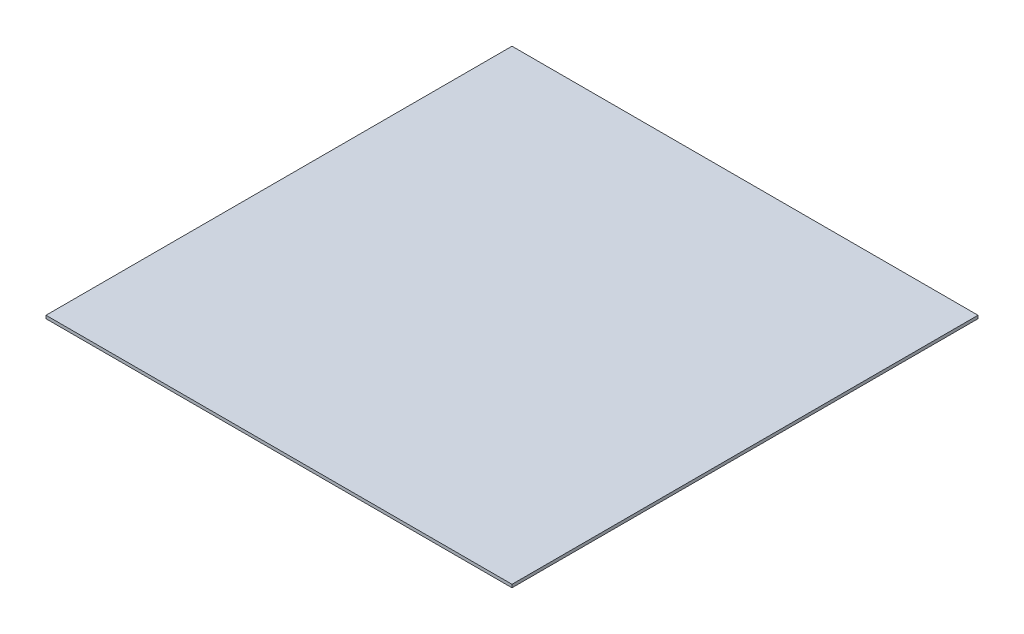
ISO-10303-21;
HEADER;
FILE_DESCRIPTION(('STEP AP214'),'2;1');
FILE_NAME('part.step','',(''),(''),'','','');
FILE_SCHEMA(('AUTOMOTIVE_DESIGN { 1 0 10303 214 1 1 1 1 }'));
ENDSEC;
DATA;
#1=APPLICATION_CONTEXT('core data for automotive mechanical design processes');
#2=APPLICATION_PROTOCOL_DEFINITION('international standard','automotive_design',2000,#1);
#3=PRODUCT_CONTEXT('',#1,'mechanical');
#4=PRODUCT('Part','Part','',(#3));
#5=PRODUCT_RELATED_PRODUCT_CATEGORY('part','',(#4));
#6=PRODUCT_DEFINITION_FORMATION('','',#4);
#7=PRODUCT_DEFINITION_CONTEXT('part definition',#1,'design');
#8=PRODUCT_DEFINITION('design','',#6,#7);
#9=PRODUCT_DEFINITION_SHAPE('','',#8);
#10=(LENGTH_UNIT() NAMED_UNIT(*) SI_UNIT(.MILLI.,.METRE.));
#11=(NAMED_UNIT(*) PLANE_ANGLE_UNIT() SI_UNIT($,.RADIAN.));
#12=(NAMED_UNIT(*) SI_UNIT($,.STERADIAN.) SOLID_ANGLE_UNIT());
#13=UNCERTAINTY_MEASURE_WITH_UNIT(LENGTH_MEASURE(1.E-05),#10,'distance_accuracy_value','');
#14=(GEOMETRIC_REPRESENTATION_CONTEXT(3) GLOBAL_UNCERTAINTY_ASSIGNED_CONTEXT((#13)) GLOBAL_UNIT_ASSIGNED_CONTEXT((#10,
#11,#12)) REPRESENTATION_CONTEXT('',''));
#15=CARTESIAN_POINT('',(0.,0.,0.));
#16=DIRECTION('',(0.,0.,1.));
#17=DIRECTION('',(1.,0.,0.));
#18=AXIS2_PLACEMENT_3D('',#15,#16,#17);
#19=CARTESIAN_POINT('',(-152.4,2.,-152.4));
#20=DIRECTION('',(1.,0.,0.));
#21=DIRECTION('',(0.,0.,-1.));
#22=AXIS2_PLACEMENT_3D('',#19,#20,#21);
#23=PLANE('',#22);
#24=DIRECTION('',(0.,0.,1.));
#25=VECTOR('',#24,1.);
#26=CARTESIAN_POINT('',(-152.4,0.,-152.4));
#27=LINE('',#26,#25);
#28=CARTESIAN_POINT('',(-152.4,0.,-152.4));
#29=VERTEX_POINT('',#28);
#30=CARTESIAN_POINT('',(-152.4,0.,152.4));
#31=VERTEX_POINT('',#30);
#32=EDGE_CURVE('E96',#29,#31,#27,.T.);
#33=ORIENTED_EDGE('',*,*,#32,.T.);
#34=DIRECTION('',(0.,-1.,0.));
#35=VECTOR('',#34,1.);
#36=CARTESIAN_POINT('',(-152.4,2.,152.4));
#37=LINE('',#36,#35);
#38=CARTESIAN_POINT('',(-152.4,2.,152.4));
#39=VERTEX_POINT('',#38);
#40=EDGE_CURVE('E11',#39,#31,#37,.T.);
#41=ORIENTED_EDGE('',*,*,#40,.F.);
#42=DIRECTION('',(0.,0.,1.));
#43=VECTOR('',#42,1.);
#44=CARTESIAN_POINT('',(-152.4,2.,-152.4));
#45=LINE('',#44,#43);
#46=CARTESIAN_POINT('',(-152.4,2.,-152.4));
#47=VERTEX_POINT('',#46);
#48=EDGE_CURVE('E84',#47,#39,#45,.T.);
#49=ORIENTED_EDGE('',*,*,#48,.F.);
#50=DIRECTION('',(0.,-1.,0.));
#51=VECTOR('',#50,1.);
#52=CARTESIAN_POINT('',(-152.4,2.,-152.4));
#53=LINE('',#52,#51);
#54=EDGE_CURVE('E92',#47,#29,#53,.T.);
#55=ORIENTED_EDGE('',*,*,#54,.T.);
#56=EDGE_LOOP('',(#33,#41,#49,#55));
#57=FACE_BOUND('',#56,.T.);
#58=ADVANCED_FACE('F33',(#57),#23,.F.);
#59=CARTESIAN_POINT('',(-152.4,2.,152.4));
#60=DIRECTION('',(0.,0.,-1.));
#61=DIRECTION('',(-1.,0.,0.));
#62=AXIS2_PLACEMENT_3D('',#59,#60,#61);
#63=PLANE('',#62);
#64=DIRECTION('',(1.,0.,0.));
#65=VECTOR('',#64,1.);
#66=CARTESIAN_POINT('',(-152.4,0.,152.4));
#67=LINE('',#66,#65);
#68=CARTESIAN_POINT('',(152.4,0.,152.4));
#69=VERTEX_POINT('',#68);
#70=EDGE_CURVE('E88',#31,#69,#67,.T.);
#71=ORIENTED_EDGE('',*,*,#70,.T.);
#72=DIRECTION('',(0.,-1.,0.));
#73=VECTOR('',#72,1.);
#74=CARTESIAN_POINT('',(152.4,2.,152.4));
#75=LINE('',#74,#73);
#76=CARTESIAN_POINT('',(152.4,2.,152.4));
#77=VERTEX_POINT('',#76);
#78=EDGE_CURVE('E41',#77,#69,#75,.T.);
#79=ORIENTED_EDGE('',*,*,#78,.F.);
#80=DIRECTION('',(1.,0.,0.));
#81=VECTOR('',#80,1.);
#82=CARTESIAN_POINT('',(-152.4,2.,152.4));
#83=LINE('',#82,#81);
#84=EDGE_CURVE('E79',#39,#77,#83,.T.);
#85=ORIENTED_EDGE('',*,*,#84,.F.);
#86=ORIENTED_EDGE('',*,*,#40,.T.);
#87=EDGE_LOOP('',(#71,#79,#85,#86));
#88=FACE_BOUND('',#87,.T.);
#89=ADVANCED_FACE('F87',(#88),#63,.F.);
#90=CARTESIAN_POINT('',(152.4,2.,-152.4));
#91=DIRECTION('',(-1.,0.,0.));
#92=DIRECTION('',(0.,0.,1.));
#93=AXIS2_PLACEMENT_3D('',#90,#91,#92);
#94=PLANE('',#93);
#95=DIRECTION('',(0.,0.,-1.));
#96=VECTOR('',#95,1.);
#97=CARTESIAN_POINT('',(152.4,0.,-152.4));
#98=LINE('',#97,#96);
#99=CARTESIAN_POINT('',(152.4,0.,-152.4));
#100=VERTEX_POINT('',#99);
#101=EDGE_CURVE('E66',#69,#100,#98,.T.);
#102=ORIENTED_EDGE('',*,*,#101,.T.);
#103=DIRECTION('',(0.,-1.,0.));
#104=VECTOR('',#103,1.);
#105=CARTESIAN_POINT('',(152.4,2.,-152.4));
#106=LINE('',#105,#104);
#107=CARTESIAN_POINT('',(152.4,2.,-152.4));
#108=VERTEX_POINT('',#107);
#109=EDGE_CURVE('E89',#108,#100,#106,.T.);
#110=ORIENTED_EDGE('',*,*,#109,.F.);
#111=DIRECTION('',(0.,0.,-1.));
#112=VECTOR('',#111,1.);
#113=CARTESIAN_POINT('',(152.4,2.,-152.4));
#114=LINE('',#113,#112);
#115=EDGE_CURVE('E82',#77,#108,#114,.T.);
#116=ORIENTED_EDGE('',*,*,#115,.F.);
#117=ORIENTED_EDGE('',*,*,#78,.T.);
#118=EDGE_LOOP('',(#102,#110,#116,#117));
#119=FACE_BOUND('',#118,.T.);
#120=ADVANCED_FACE('F90',(#119),#94,.F.);
#121=CARTESIAN_POINT('',(-152.4,2.,-152.4));
#122=DIRECTION('',(0.,0.,1.));
#123=DIRECTION('',(1.,0.,0.));
#124=AXIS2_PLACEMENT_3D('',#121,#122,#123);
#125=PLANE('',#124);
#126=DIRECTION('',(-1.,0.,0.));
#127=VECTOR('',#126,1.);
#128=CARTESIAN_POINT('',(-152.4,0.,-152.4));
#129=LINE('',#128,#127);
#130=EDGE_CURVE('E72',#100,#29,#129,.T.);
#131=ORIENTED_EDGE('',*,*,#130,.T.);
#132=ORIENTED_EDGE('',*,*,#54,.F.);
#133=DIRECTION('',(-1.,0.,0.));
#134=VECTOR('',#133,1.);
#135=CARTESIAN_POINT('',(-152.4,2.,-152.4));
#136=LINE('',#135,#134);
#137=EDGE_CURVE('E49',#108,#47,#136,.T.);
#138=ORIENTED_EDGE('',*,*,#137,.F.);
#139=ORIENTED_EDGE('',*,*,#109,.T.);
#140=EDGE_LOOP('',(#131,#132,#138,#139));
#141=FACE_BOUND('',#140,.T.);
#142=ADVANCED_FACE('F103',(#141),#125,.F.);
#143=CARTESIAN_POINT('',(0.,2.,0.));
#144=DIRECTION('',(0.,1.,0.));
#145=DIRECTION('',(0.,0.,1.));
#146=AXIS2_PLACEMENT_3D('',#143,#144,#145);
#147=PLANE('',#146);
#148=ORIENTED_EDGE('',*,*,#48,.T.);
#149=ORIENTED_EDGE('',*,*,#84,.T.);
#150=ORIENTED_EDGE('',*,*,#115,.T.);
#151=ORIENTED_EDGE('',*,*,#137,.T.);
#152=EDGE_LOOP('',(#148,#149,#150,#151));
#153=FACE_BOUND('',#152,.T.);
#154=ADVANCED_FACE('F80',(#153),#147,.T.);
#155=CARTESIAN_POINT('',(0.,0.,0.));
#156=DIRECTION('',(0.,1.,0.));
#157=DIRECTION('',(0.,0.,1.));
#158=AXIS2_PLACEMENT_3D('',#155,#156,#157);
#159=PLANE('',#158);
#160=ORIENTED_EDGE('',*,*,#32,.F.);
#161=ORIENTED_EDGE('',*,*,#130,.F.);
#162=ORIENTED_EDGE('',*,*,#101,.F.);
#163=ORIENTED_EDGE('',*,*,#70,.F.);
#164=EDGE_LOOP('',(#160,#161,#162,#163));
#165=FACE_BOUND('',#164,.T.);
#166=ADVANCED_FACE('F106',(#165),#159,.F.);
#167=CLOSED_SHELL('',(#58,#89,#120,#142,#154,#166));
#168=MANIFOLD_SOLID_BREP('B2',#167);
#169=ADVANCED_BREP_SHAPE_REPRESENTATION('',(#18,#168),#14);
#170=SHAPE_DEFINITION_REPRESENTATION(#9,#169);
ENDSEC;
END-ISO-10303-21;
